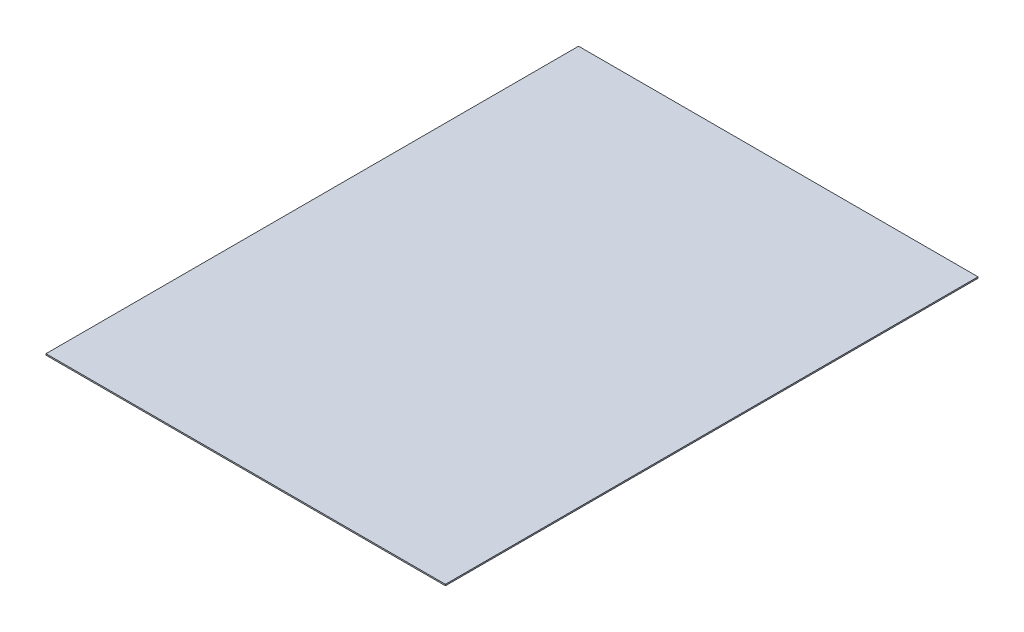
ISO-10303-21;
HEADER;
FILE_DESCRIPTION(('STEP AP214'),'2;1');
FILE_NAME('part.step','',(''),(''),'','','');
FILE_SCHEMA(('AUTOMOTIVE_DESIGN { 1 0 10303 214 1 1 1 1 }'));
ENDSEC;
DATA;
#1=APPLICATION_CONTEXT('core data for automotive mechanical design processes');
#2=APPLICATION_PROTOCOL_DEFINITION('international standard','automotive_design',2000,#1);
#3=PRODUCT_CONTEXT('',#1,'mechanical');
#4=PRODUCT('Part','Part','',(#3));
#5=PRODUCT_RELATED_PRODUCT_CATEGORY('part','',(#4));
#6=PRODUCT_DEFINITION_FORMATION('','',#4);
#7=PRODUCT_DEFINITION_CONTEXT('part definition',#1,'design');
#8=PRODUCT_DEFINITION('design','',#6,#7);
#9=PRODUCT_DEFINITION_SHAPE('','',#8);
#10=(LENGTH_UNIT() NAMED_UNIT(*) SI_UNIT(.MILLI.,.METRE.));
#11=(NAMED_UNIT(*) PLANE_ANGLE_UNIT() SI_UNIT($,.RADIAN.));
#12=(NAMED_UNIT(*) SI_UNIT($,.STERADIAN.) SOLID_ANGLE_UNIT());
#13=UNCERTAINTY_MEASURE_WITH_UNIT(LENGTH_MEASURE(1.E-05),#10,'distance_accuracy_value','');
#14=(GEOMETRIC_REPRESENTATION_CONTEXT(3) GLOBAL_UNCERTAINTY_ASSIGNED_CONTEXT((#13)) GLOBAL_UNIT_ASSIGNED_CONTEXT((#10,
#11,#12)) REPRESENTATION_CONTEXT('',''));
#15=CARTESIAN_POINT('',(0.,0.,0.));
#16=DIRECTION('',(0.,0.,1.));
#17=DIRECTION('',(1.,0.,0.));
#18=AXIS2_PLACEMENT_3D('',#15,#16,#17);
#19=CARTESIAN_POINT('',(1500.,10.,2000.));
#20=DIRECTION('',(-1.,0.,0.));
#21=DIRECTION('',(0.,0.,1.));
#22=AXIS2_PLACEMENT_3D('',#19,#20,#21);
#23=PLANE('',#22);
#24=DIRECTION('',(0.,0.,-1.));
#25=VECTOR('',#24,1.);
#26=CARTESIAN_POINT('',(1500.,0.,2000.));
#27=LINE('',#26,#25);
#28=CARTESIAN_POINT('',(1500.,0.,2000.));
#29=VERTEX_POINT('',#28);
#30=CARTESIAN_POINT('',(1500.,0.,-2000.));
#31=VERTEX_POINT('',#30);
#32=EDGE_CURVE('E107',#29,#31,#27,.T.);
#33=ORIENTED_EDGE('',*,*,#32,.T.);
#34=DIRECTION('',(0.,-1.,0.));
#35=VECTOR('',#34,1.);
#36=CARTESIAN_POINT('',(1500.,10.,-2000.));
#37=LINE('',#36,#35);
#38=CARTESIAN_POINT('',(1500.,10.,-2000.));
#39=VERTEX_POINT('',#38);
#40=EDGE_CURVE('E11',#39,#31,#37,.T.);
#41=ORIENTED_EDGE('',*,*,#40,.F.);
#42=DIRECTION('',(0.,0.,-1.));
#43=VECTOR('',#42,1.);
#44=CARTESIAN_POINT('',(1500.,10.,2000.));
#45=LINE('',#44,#43);
#46=CARTESIAN_POINT('',(1500.,10.,2000.));
#47=VERTEX_POINT('',#46);
#48=EDGE_CURVE('E91',#47,#39,#45,.T.);
#49=ORIENTED_EDGE('',*,*,#48,.F.);
#50=DIRECTION('',(0.,-1.,0.));
#51=VECTOR('',#50,1.);
#52=CARTESIAN_POINT('',(1500.,10.,2000.));
#53=LINE('',#52,#51);
#54=EDGE_CURVE('E103',#47,#29,#53,.T.);
#55=ORIENTED_EDGE('',*,*,#54,.T.);
#56=EDGE_LOOP('',(#33,#41,#49,#55));
#57=FACE_BOUND('',#56,.T.);
#58=ADVANCED_FACE('F39',(#57),#23,.F.);
#59=CARTESIAN_POINT('',(-1500.,10.,-2000.));
#60=DIRECTION('',(0.,0.,1.));
#61=DIRECTION('',(1.,0.,0.));
#62=AXIS2_PLACEMENT_3D('',#59,#60,#61);
#63=PLANE('',#62);
#64=DIRECTION('',(-1.,0.,0.));
#65=VECTOR('',#64,1.);
#66=CARTESIAN_POINT('',(-1500.,0.,-2000.));
#67=LINE('',#66,#65);
#68=CARTESIAN_POINT('',(-1500.,0.,-2000.));
#69=VERTEX_POINT('',#68);
#70=EDGE_CURVE('E96',#31,#69,#67,.T.);
#71=ORIENTED_EDGE('',*,*,#70,.T.);
#72=DIRECTION('',(0.,-1.,0.));
#73=VECTOR('',#72,1.);
#74=CARTESIAN_POINT('',(-1500.,10.,-2000.));
#75=LINE('',#74,#73);
#76=CARTESIAN_POINT('',(-1500.,10.,-2000.));
#77=VERTEX_POINT('',#76);
#78=EDGE_CURVE('E48',#77,#69,#75,.T.);
#79=ORIENTED_EDGE('',*,*,#78,.F.);
#80=DIRECTION('',(-1.,0.,0.));
#81=VECTOR('',#80,1.);
#82=CARTESIAN_POINT('',(-1500.,10.,-2000.));
#83=LINE('',#82,#81);
#84=EDGE_CURVE('E86',#39,#77,#83,.T.);
#85=ORIENTED_EDGE('',*,*,#84,.F.);
#86=ORIENTED_EDGE('',*,*,#40,.T.);
#87=EDGE_LOOP('',(#71,#79,#85,#86));
#88=FACE_BOUND('',#87,.T.);
#89=ADVANCED_FACE('F95',(#88),#63,.F.);
#90=CARTESIAN_POINT('',(-1500.,10.,2000.));
#91=DIRECTION('',(1.,0.,0.));
#92=DIRECTION('',(0.,0.,-1.));
#93=AXIS2_PLACEMENT_3D('',#90,#91,#92);
#94=PLANE('',#93);
#95=DIRECTION('',(0.,0.,1.));
#96=VECTOR('',#95,1.);
#97=CARTESIAN_POINT('',(-1500.,0.,2000.));
#98=LINE('',#97,#96);
#99=CARTESIAN_POINT('',(-1500.,0.,2000.));
#100=VERTEX_POINT('',#99);
#101=EDGE_CURVE('E73',#69,#100,#98,.T.);
#102=ORIENTED_EDGE('',*,*,#101,.T.);
#103=DIRECTION('',(0.,-1.,0.));
#104=VECTOR('',#103,1.);
#105=CARTESIAN_POINT('',(-1500.,10.,2000.));
#106=LINE('',#105,#104);
#107=CARTESIAN_POINT('',(-1500.,10.,2000.));
#108=VERTEX_POINT('',#107);
#109=EDGE_CURVE('E98',#108,#100,#106,.T.);
#110=ORIENTED_EDGE('',*,*,#109,.F.);
#111=DIRECTION('',(0.,0.,1.));
#112=VECTOR('',#111,1.);
#113=CARTESIAN_POINT('',(-1500.,10.,2000.));
#114=LINE('',#113,#112);
#115=EDGE_CURVE('E89',#77,#108,#114,.T.);
#116=ORIENTED_EDGE('',*,*,#115,.F.);
#117=ORIENTED_EDGE('',*,*,#78,.T.);
#118=EDGE_LOOP('',(#102,#110,#116,#117));
#119=FACE_BOUND('',#118,.T.);
#120=ADVANCED_FACE('F99',(#119),#94,.F.);
#121=CARTESIAN_POINT('',(-1500.,10.,2000.));
#122=DIRECTION('',(0.,0.,-1.));
#123=DIRECTION('',(-1.,0.,0.));
#124=AXIS2_PLACEMENT_3D('',#121,#122,#123);
#125=PLANE('',#124);
#126=DIRECTION('',(1.,0.,0.));
#127=VECTOR('',#126,1.);
#128=CARTESIAN_POINT('',(-1500.,0.,2000.));
#129=LINE('',#128,#127);
#130=EDGE_CURVE('E79',#100,#29,#129,.T.);
#131=ORIENTED_EDGE('',*,*,#130,.T.);
#132=ORIENTED_EDGE('',*,*,#54,.F.);
#133=DIRECTION('',(1.,0.,0.));
#134=VECTOR('',#133,1.);
#135=CARTESIAN_POINT('',(-1500.,10.,2000.));
#136=LINE('',#135,#134);
#137=EDGE_CURVE('E56',#108,#47,#136,.T.);
#138=ORIENTED_EDGE('',*,*,#137,.F.);
#139=ORIENTED_EDGE('',*,*,#109,.T.);
#140=EDGE_LOOP('',(#131,#132,#138,#139));
#141=FACE_BOUND('',#140,.T.);
#142=ADVANCED_FACE('F120',(#141),#125,.F.);
#143=CARTESIAN_POINT('',(0.,10.,0.));
#144=DIRECTION('',(0.,-1.,0.));
#145=DIRECTION('',(0.,0.,-1.));
#146=AXIS2_PLACEMENT_3D('',#143,#144,#145);
#147=PLANE('',#146);
#148=ORIENTED_EDGE('',*,*,#48,.T.);
#149=ORIENTED_EDGE('',*,*,#84,.T.);
#150=ORIENTED_EDGE('',*,*,#115,.T.);
#151=ORIENTED_EDGE('',*,*,#137,.T.);
#152=EDGE_LOOP('',(#148,#149,#150,#151));
#153=FACE_BOUND('',#152,.T.);
#154=ADVANCED_FACE('F87',(#153),#147,.F.);
#155=CARTESIAN_POINT('',(0.,0.,0.));
#156=DIRECTION('',(0.,-1.,0.));
#157=DIRECTION('',(0.,0.,-1.));
#158=AXIS2_PLACEMENT_3D('',#155,#156,#157);
#159=PLANE('',#158);
#160=ORIENTED_EDGE('',*,*,#32,.F.);
#161=ORIENTED_EDGE('',*,*,#130,.F.);
#162=ORIENTED_EDGE('',*,*,#101,.F.);
#163=ORIENTED_EDGE('',*,*,#70,.F.);
#164=EDGE_LOOP('',(#160,#161,#162,#163));
#165=FACE_BOUND('',#164,.T.);
#166=ADVANCED_FACE('F123',(#165),#159,.T.);
#167=CLOSED_SHELL('',(#58,#89,#120,#142,#154,#166));
#168=MANIFOLD_SOLID_BREP('B2',#167);
#169=ADVANCED_BREP_SHAPE_REPRESENTATION('',(#18,#168),#14);
#170=SHAPE_DEFINITION_REPRESENTATION(#9,#169);
ENDSEC;
END-ISO-10303-21;
